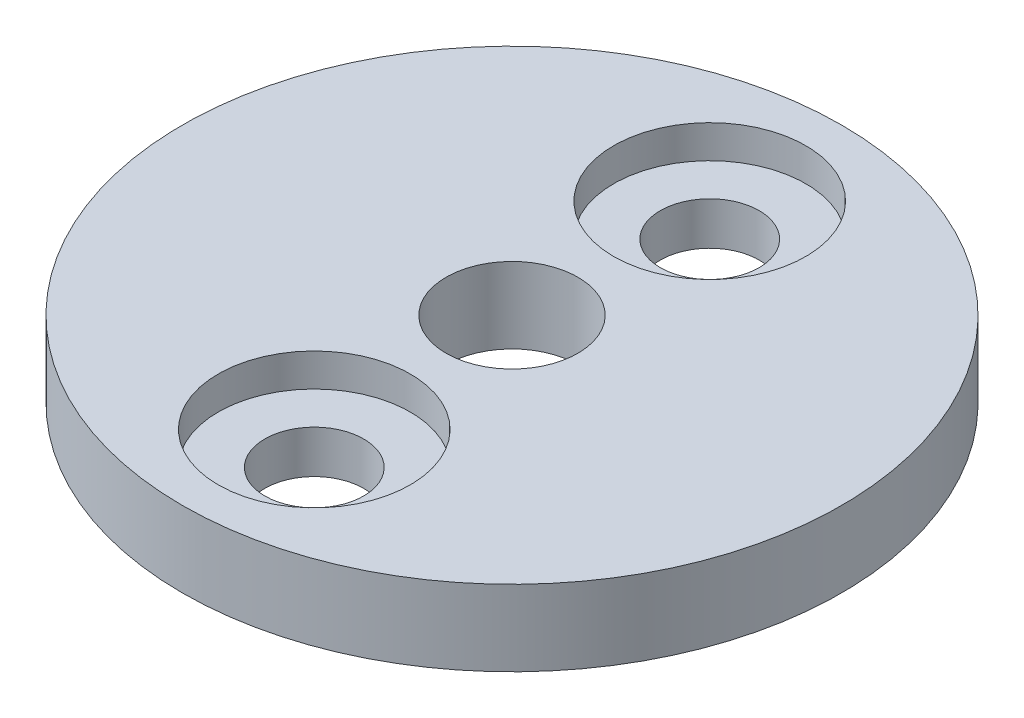
ISO-10303-21;
HEADER;
FILE_DESCRIPTION(('STEP AP214'),'2;1');
FILE_NAME('part.step','',(''),(''),'','','');
FILE_SCHEMA(('AUTOMOTIVE_DESIGN { 1 0 10303 214 1 1 1 1 }'));
ENDSEC;
DATA;
#1=APPLICATION_CONTEXT('core data for automotive mechanical design processes');
#2=APPLICATION_PROTOCOL_DEFINITION('international standard','automotive_design',2000,#1);
#3=PRODUCT_CONTEXT('',#1,'mechanical');
#4=PRODUCT('Part','Part','',(#3));
#5=PRODUCT_RELATED_PRODUCT_CATEGORY('part','',(#4));
#6=PRODUCT_DEFINITION_FORMATION('','',#4);
#7=PRODUCT_DEFINITION_CONTEXT('part definition',#1,'design');
#8=PRODUCT_DEFINITION('design','',#6,#7);
#9=PRODUCT_DEFINITION_SHAPE('','',#8);
#10=(LENGTH_UNIT() NAMED_UNIT(*) SI_UNIT(.MILLI.,.METRE.));
#11=(NAMED_UNIT(*) PLANE_ANGLE_UNIT() SI_UNIT($,.RADIAN.));
#12=(NAMED_UNIT(*) SI_UNIT($,.STERADIAN.) SOLID_ANGLE_UNIT());
#13=UNCERTAINTY_MEASURE_WITH_UNIT(LENGTH_MEASURE(1.E-05),#10,'distance_accuracy_value','');
#14=(GEOMETRIC_REPRESENTATION_CONTEXT(3) GLOBAL_UNCERTAINTY_ASSIGNED_CONTEXT((#13)) GLOBAL_UNIT_ASSIGNED_CONTEXT((#10,
#11,#12)) REPRESENTATION_CONTEXT('',''));
#15=CARTESIAN_POINT('',(0.,0.,0.));
#16=DIRECTION('',(0.,0.,1.));
#17=DIRECTION('',(1.,0.,0.));
#18=AXIS2_PLACEMENT_3D('',#15,#16,#17);
#19=CARTESIAN_POINT('',(0.,19.175,6.));
#20=DIRECTION('',(0.,-1.,0.));
#21=DIRECTION('',(0.,0.,-1.));
#22=AXIS2_PLACEMENT_3D('',#19,#20,#21);
#23=CYLINDRICAL_SURFACE('',#22,1.49999999999999);
#24=CARTESIAN_POINT('',(0.,16.875,6.));
#25=DIRECTION('',(0.,1.,0.));
#26=DIRECTION('',(0.,0.,1.));
#27=AXIS2_PLACEMENT_3D('',#24,#25,#26);
#28=CIRCLE('',#27,1.49999999999999);
#29=CARTESIAN_POINT('',(0.,16.875,7.49999999999999));
#30=VERTEX_POINT('',#29);
#31=EDGE_CURVE('E50',#30,#30,#28,.T.);
#32=ORIENTED_EDGE('',*,*,#31,.F.);
#33=EDGE_LOOP('',(#32));
#34=FACE_BOUND('',#33,.T.);
#35=CARTESIAN_POINT('',(0.,18.175,6.));
#36=DIRECTION('',(0.,1.,0.));
#37=DIRECTION('',(0.,0.,1.));
#38=AXIS2_PLACEMENT_3D('',#35,#36,#37);
#39=CIRCLE('',#38,1.49999999999999);
#40=CARTESIAN_POINT('',(0.,18.175,7.49999999999999));
#41=VERTEX_POINT('',#40);
#42=EDGE_CURVE('E34',#41,#41,#39,.T.);
#43=ORIENTED_EDGE('',*,*,#42,.T.);
#44=EDGE_LOOP('',(#43));
#45=FACE_BOUND('',#44,.T.);
#46=ADVANCED_FACE('F30',(#34,#45),#23,.F.);
#47=CARTESIAN_POINT('',(0.,19.175,-6.));
#48=DIRECTION('',(0.,-1.,0.));
#49=DIRECTION('',(0.,0.,-1.));
#50=AXIS2_PLACEMENT_3D('',#47,#48,#49);
#51=CYLINDRICAL_SURFACE('',#50,1.49999999999999);
#52=CARTESIAN_POINT('',(0.,16.875,-6.));
#53=DIRECTION('',(0.,1.,0.));
#54=DIRECTION('',(0.,0.,1.));
#55=AXIS2_PLACEMENT_3D('',#52,#53,#54);
#56=CIRCLE('',#55,1.49999999999999);
#57=CARTESIAN_POINT('',(0.,16.875,-4.50000000000001));
#58=VERTEX_POINT('',#57);
#59=EDGE_CURVE('E55',#58,#58,#56,.T.);
#60=ORIENTED_EDGE('',*,*,#59,.F.);
#61=EDGE_LOOP('',(#60));
#62=FACE_BOUND('',#61,.T.);
#63=CARTESIAN_POINT('',(0.,18.175,-6.));
#64=DIRECTION('',(0.,1.,0.));
#65=DIRECTION('',(0.,0.,1.));
#66=AXIS2_PLACEMENT_3D('',#63,#64,#65);
#67=CIRCLE('',#66,1.49999999999999);
#68=CARTESIAN_POINT('',(0.,18.175,-4.50000000000001));
#69=VERTEX_POINT('',#68);
#70=EDGE_CURVE('E48',#69,#69,#67,.T.);
#71=ORIENTED_EDGE('',*,*,#70,.T.);
#72=EDGE_LOOP('',(#71));
#73=FACE_BOUND('',#72,.T.);
#74=ADVANCED_FACE('F93',(#62,#73),#51,.F.);
#75=CARTESIAN_POINT('',(0.,19.175,0.));
#76=DIRECTION('',(0.,1.,0.));
#77=DIRECTION('',(0.,0.,1.));
#78=AXIS2_PLACEMENT_3D('',#75,#76,#77);
#79=PLANE('',#78);
#80=CARTESIAN_POINT('',(0.,19.175,6.));
#81=DIRECTION('',(0.,1.,0.));
#82=DIRECTION('',(0.,0.,1.));
#83=AXIS2_PLACEMENT_3D('',#80,#81,#82);
#84=CIRCLE('',#83,2.915);
#85=CARTESIAN_POINT('',(0.,19.175,8.915));
#86=VERTEX_POINT('',#85);
#87=EDGE_CURVE('E65',#86,#86,#84,.T.);
#88=ORIENTED_EDGE('',*,*,#87,.F.);
#89=EDGE_LOOP('',(#88));
#90=FACE_BOUND('',#89,.T.);
#91=CARTESIAN_POINT('',(0.,19.175,-6.));
#92=DIRECTION('',(0.,1.,0.));
#93=DIRECTION('',(0.,0.,1.));
#94=AXIS2_PLACEMENT_3D('',#91,#92,#93);
#95=CIRCLE('',#94,2.915);
#96=CARTESIAN_POINT('',(0.,19.175,-3.085));
#97=VERTEX_POINT('',#96);
#98=EDGE_CURVE('E58',#97,#97,#95,.T.);
#99=ORIENTED_EDGE('',*,*,#98,.F.);
#100=EDGE_LOOP('',(#99));
#101=FACE_BOUND('',#100,.T.);
#102=CARTESIAN_POINT('',(0.,19.175,0.));
#103=DIRECTION('',(0.,1.,0.));
#104=DIRECTION('',(0.,0.,1.));
#105=AXIS2_PLACEMENT_3D('',#102,#103,#104);
#106=CIRCLE('',#105,10.);
#107=CARTESIAN_POINT('',(0.,19.175,10.));
#108=VERTEX_POINT('',#107);
#109=EDGE_CURVE('E10',#108,#108,#106,.T.);
#110=ORIENTED_EDGE('',*,*,#109,.T.);
#111=EDGE_LOOP('',(#110));
#112=FACE_BOUND('',#111,.T.);
#113=CARTESIAN_POINT('',(0.,19.175,0.));
#114=DIRECTION('',(0.,1.,0.));
#115=DIRECTION('',(0.,0.,1.));
#116=AXIS2_PLACEMENT_3D('',#113,#114,#115);
#117=CIRCLE('',#116,2.);
#118=CARTESIAN_POINT('',(0.,19.175,2.));
#119=VERTEX_POINT('',#118);
#120=EDGE_CURVE('E43',#119,#119,#117,.T.);
#121=ORIENTED_EDGE('',*,*,#120,.F.);
#122=EDGE_LOOP('',(#121));
#123=FACE_BOUND('',#122,.T.);
#124=ADVANCED_FACE('F99',(#90,#101,#112,#123),#79,.T.);
#125=CARTESIAN_POINT('',(0.,16.875,0.));
#126=DIRECTION('',(0.,1.,0.));
#127=DIRECTION('',(0.,0.,1.));
#128=AXIS2_PLACEMENT_3D('',#125,#126,#127);
#129=PLANE('',#128);
#130=ORIENTED_EDGE('',*,*,#59,.T.);
#131=EDGE_LOOP('',(#130));
#132=FACE_BOUND('',#131,.T.);
#133=CARTESIAN_POINT('',(0.,16.875,0.));
#134=DIRECTION('',(0.,1.,0.));
#135=DIRECTION('',(0.,0.,1.));
#136=AXIS2_PLACEMENT_3D('',#133,#134,#135);
#137=CIRCLE('',#136,10.);
#138=CARTESIAN_POINT('',(0.,16.875,10.));
#139=VERTEX_POINT('',#138);
#140=EDGE_CURVE('E38',#139,#139,#137,.T.);
#141=ORIENTED_EDGE('',*,*,#140,.F.);
#142=EDGE_LOOP('',(#141));
#143=FACE_BOUND('',#142,.T.);
#144=CARTESIAN_POINT('',(0.,16.875,0.));
#145=DIRECTION('',(0.,1.,0.));
#146=DIRECTION('',(0.,0.,1.));
#147=AXIS2_PLACEMENT_3D('',#144,#145,#146);
#148=CIRCLE('',#147,2.);
#149=CARTESIAN_POINT('',(0.,16.875,2.));
#150=VERTEX_POINT('',#149);
#151=EDGE_CURVE('E46',#150,#150,#148,.T.);
#152=ORIENTED_EDGE('',*,*,#151,.T.);
#153=EDGE_LOOP('',(#152));
#154=FACE_BOUND('',#153,.T.);
#155=ORIENTED_EDGE('',*,*,#31,.T.);
#156=EDGE_LOOP('',(#155));
#157=FACE_BOUND('',#156,.T.);
#158=ADVANCED_FACE('F75',(#132,#143,#154,#157),#129,.F.);
#159=CARTESIAN_POINT('',(0.,19.175,0.));
#160=DIRECTION('',(0.,-1.,0.));
#161=DIRECTION('',(0.,0.,-1.));
#162=AXIS2_PLACEMENT_3D('',#159,#160,#161);
#163=CYLINDRICAL_SURFACE('',#162,10.);
#164=ORIENTED_EDGE('',*,*,#109,.F.);
#165=EDGE_LOOP('',(#164));
#166=FACE_BOUND('',#165,.T.);
#167=ORIENTED_EDGE('',*,*,#140,.T.);
#168=EDGE_LOOP('',(#167));
#169=FACE_BOUND('',#168,.T.);
#170=ADVANCED_FACE('F32',(#166,#169),#163,.T.);
#171=CARTESIAN_POINT('',(0.,19.175,0.));
#172=DIRECTION('',(0.,-1.,0.));
#173=DIRECTION('',(0.,0.,-1.));
#174=AXIS2_PLACEMENT_3D('',#171,#172,#173);
#175=CYLINDRICAL_SURFACE('',#174,2.);
#176=ORIENTED_EDGE('',*,*,#120,.T.);
#177=EDGE_LOOP('',(#176));
#178=FACE_BOUND('',#177,.T.);
#179=ORIENTED_EDGE('',*,*,#151,.F.);
#180=EDGE_LOOP('',(#179));
#181=FACE_BOUND('',#180,.T.);
#182=ADVANCED_FACE('F78',(#178,#181),#175,.F.);
#183=CARTESIAN_POINT('',(0.,18.175,-6.));
#184=DIRECTION('',(0.,1.,0.));
#185=DIRECTION('',(0.,0.,1.));
#186=AXIS2_PLACEMENT_3D('',#183,#184,#185);
#187=CYLINDRICAL_SURFACE('',#186,2.915);
#188=CARTESIAN_POINT('',(0.,18.175,-6.));
#189=DIRECTION('',(0.,1.,0.));
#190=DIRECTION('',(0.,0.,1.));
#191=AXIS2_PLACEMENT_3D('',#188,#189,#190);
#192=CIRCLE('',#191,2.915);
#193=CARTESIAN_POINT('',(0.,18.175,-3.085));
#194=VERTEX_POINT('',#193);
#195=EDGE_CURVE('E51',#194,#194,#192,.T.);
#196=ORIENTED_EDGE('',*,*,#195,.F.);
#197=EDGE_LOOP('',(#196));
#198=FACE_BOUND('',#197,.T.);
#199=ORIENTED_EDGE('',*,*,#98,.T.);
#200=EDGE_LOOP('',(#199));
#201=FACE_BOUND('',#200,.T.);
#202=ADVANCED_FACE('F80',(#198,#201),#187,.F.);
#203=CARTESIAN_POINT('',(0.,18.175,-6.));
#204=DIRECTION('',(0.,1.,0.));
#205=DIRECTION('',(0.,0.,1.));
#206=AXIS2_PLACEMENT_3D('',#203,#204,#205);
#207=PLANE('',#206);
#208=ORIENTED_EDGE('',*,*,#70,.F.);
#209=EDGE_LOOP('',(#208));
#210=FACE_BOUND('',#209,.T.);
#211=ORIENTED_EDGE('',*,*,#195,.T.);
#212=EDGE_LOOP('',(#211));
#213=FACE_BOUND('',#212,.T.);
#214=ADVANCED_FACE('F86',(#210,#213),#207,.T.);
#215=CARTESIAN_POINT('',(0.,18.175,6.));
#216=DIRECTION('',(0.,1.,0.));
#217=DIRECTION('',(0.,0.,1.));
#218=AXIS2_PLACEMENT_3D('',#215,#216,#217);
#219=CYLINDRICAL_SURFACE('',#218,2.915);
#220=CARTESIAN_POINT('',(0.,18.175,6.));
#221=DIRECTION('',(0.,1.,0.));
#222=DIRECTION('',(0.,0.,1.));
#223=AXIS2_PLACEMENT_3D('',#220,#221,#222);
#224=CIRCLE('',#223,2.915);
#225=CARTESIAN_POINT('',(0.,18.175,8.915));
#226=VERTEX_POINT('',#225);
#227=EDGE_CURVE('E121',#226,#226,#224,.T.);
#228=ORIENTED_EDGE('',*,*,#227,.F.);
#229=EDGE_LOOP('',(#228));
#230=FACE_BOUND('',#229,.T.);
#231=ORIENTED_EDGE('',*,*,#87,.T.);
#232=EDGE_LOOP('',(#231));
#233=FACE_BOUND('',#232,.T.);
#234=ADVANCED_FACE('F106',(#230,#233),#219,.F.);
#235=CARTESIAN_POINT('',(0.,18.175,6.));
#236=DIRECTION('',(0.,1.,0.));
#237=DIRECTION('',(0.,0.,1.));
#238=AXIS2_PLACEMENT_3D('',#235,#236,#237);
#239=PLANE('',#238);
#240=ORIENTED_EDGE('',*,*,#42,.F.);
#241=EDGE_LOOP('',(#240));
#242=FACE_BOUND('',#241,.T.);
#243=ORIENTED_EDGE('',*,*,#227,.T.);
#244=EDGE_LOOP('',(#243));
#245=FACE_BOUND('',#244,.T.);
#246=ADVANCED_FACE('F110',(#242,#245),#239,.T.);
#247=CLOSED_SHELL('',(#46,#74,#124,#158,#170,#182,#202,#214,#234,#246));
#248=MANIFOLD_SOLID_BREP('B2',#247);
#249=ADVANCED_BREP_SHAPE_REPRESENTATION('',(#18,#248),#14);
#250=SHAPE_DEFINITION_REPRESENTATION(#9,#249);
ENDSEC;
END-ISO-10303-21;
